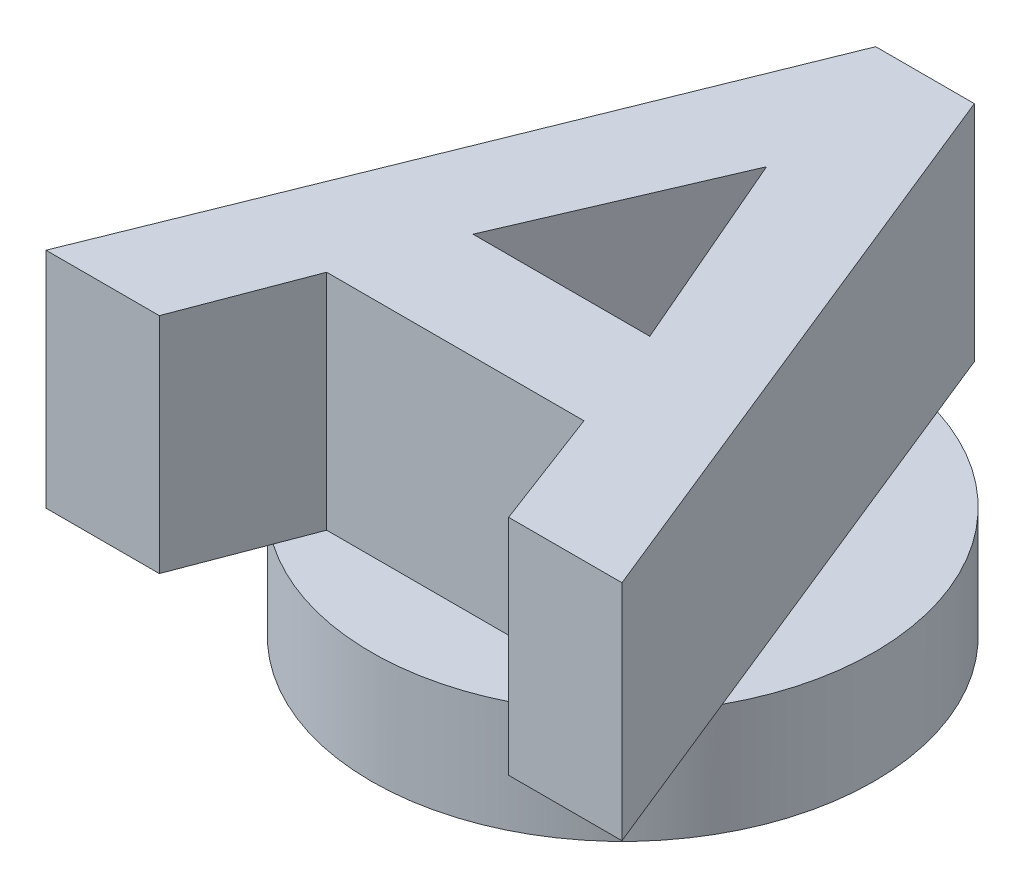
ISO-10303-21;
HEADER;
FILE_DESCRIPTION(('STEP AP214'),'2;1');
FILE_NAME('part.step','',(''),(''),'','','');
FILE_SCHEMA(('AUTOMOTIVE_DESIGN { 1 0 10303 214 1 1 1 1 }'));
ENDSEC;
DATA;
#1=APPLICATION_CONTEXT('core data for automotive mechanical design processes');
#2=APPLICATION_PROTOCOL_DEFINITION('international standard','automotive_design',2000,#1);
#3=PRODUCT_CONTEXT('',#1,'mechanical');
#4=PRODUCT('Part','Part','',(#3));
#5=PRODUCT_RELATED_PRODUCT_CATEGORY('part','',(#4));
#6=PRODUCT_DEFINITION_FORMATION('','',#4);
#7=PRODUCT_DEFINITION_CONTEXT('part definition',#1,'design');
#8=PRODUCT_DEFINITION('design','',#6,#7);
#9=PRODUCT_DEFINITION_SHAPE('','',#8);
#10=(LENGTH_UNIT() NAMED_UNIT(*) SI_UNIT(.MILLI.,.METRE.));
#11=(NAMED_UNIT(*) PLANE_ANGLE_UNIT() SI_UNIT($,.RADIAN.));
#12=(NAMED_UNIT(*) SI_UNIT($,.STERADIAN.) SOLID_ANGLE_UNIT());
#13=UNCERTAINTY_MEASURE_WITH_UNIT(LENGTH_MEASURE(1.E-05),#10,'distance_accuracy_value','');
#14=(GEOMETRIC_REPRESENTATION_CONTEXT(3) GLOBAL_UNCERTAINTY_ASSIGNED_CONTEXT((#13)) GLOBAL_UNIT_ASSIGNED_CONTEXT((#10,
#11,#12)) REPRESENTATION_CONTEXT('',''));
#15=CARTESIAN_POINT('',(0.,0.,0.));
#16=DIRECTION('',(0.,0.,1.));
#17=DIRECTION('',(1.,0.,0.));
#18=AXIS2_PLACEMENT_3D('',#15,#16,#17);
#19=CARTESIAN_POINT('',(0.,10.,0.));
#20=DIRECTION('',(0.,1.,0.));
#21=DIRECTION('',(0.,0.,1.));
#22=AXIS2_PLACEMENT_3D('',#19,#20,#21);
#23=PLANE('',#22);
#24=CARTESIAN_POINT('',(0.,10.,0.));
#25=DIRECTION('',(0.,1.,0.));
#26=DIRECTION('',(0.,0.,1.));
#27=AXIS2_PLACEMENT_3D('',#24,#25,#26);
#28=CIRCLE('',#27,22.5);
#29=CARTESIAN_POINT('',(-6.6136383890685,10.,-21.5060407155441));
#30=VERTEX_POINT('',#29);
#31=CARTESIAN_POINT('',(-19.6896862438374,10.,10.8888133246576));
#32=VERTEX_POINT('',#31);
#33=EDGE_CURVE('E313',#30,#32,#28,.T.);
#34=ORIENTED_EDGE('',*,*,#33,.T.);
#35=DIRECTION('',(0.3743033331008,0.,-0.927306322004564));
#36=VECTOR('',#35,1.);
#37=CARTESIAN_POINT('',(-25.7432937293359,10.,25.8861376758281));
#38=LINE('',#37,#36);
#39=EDGE_CURVE('E11',#32,#30,#38,.T.);
#40=ORIENTED_EDGE('',*,*,#39,.T.);
#41=EDGE_LOOP('',(#34,#40));
#42=FACE_BOUND('',#41,.T.);
#43=ADVANCED_FACE('F43',(#42),#23,.T.);
#44=CARTESIAN_POINT('',(19.7302042494278,10.,10.8152226179521));
#45=VERTEX_POINT('',#44);
#46=CARTESIAN_POINT('',(6.68648840026957,10.,-21.4835023418683));
#47=VERTEX_POINT('',#46);
#48=EDGE_CURVE('E300',#45,#47,#28,.T.);
#49=ORIENTED_EDGE('',*,*,#48,.T.);
#50=DIRECTION('',(0.374463049601283,0.,0.92724183710794));
#51=VECTOR('',#50,1.);
#52=CARTESIAN_POINT('',(4.44634302280082,10.,-27.0305289908385));
#53=LINE('',#52,#51);
#54=EDGE_CURVE('E52',#47,#45,#53,.T.);
#55=ORIENTED_EDGE('',*,*,#54,.T.);
#56=EDGE_LOOP('',(#49,#55));
#57=FACE_BOUND('',#56,.T.);
#58=ADVANCED_FACE('F335',(#57),#23,.T.);
#59=CARTESIAN_POINT('',(-12.7957142623065,10.,18.5072876596601));
#60=VERTEX_POINT('',#59);
#61=CARTESIAN_POINT('',(12.8594130005783,10.,18.463084717364));
#62=VERTEX_POINT('',#61);
#63=EDGE_CURVE('E301',#60,#62,#28,.T.);
#64=ORIENTED_EDGE('',*,*,#63,.T.);
#65=DIRECTION('',(-0.354323863096985,0.,-0.935122772709567));
#66=VECTOR('',#65,1.);
#67=CARTESIAN_POINT('',(15.6720541606213,10.,25.8861376758281));
#68=LINE('',#67,#66);
#69=CARTESIAN_POINT('',(11.5591401648948,10.,15.0314368211273));
#70=VERTEX_POINT('',#69);
#71=EDGE_CURVE('E273',#62,#70,#68,.T.);
#72=ORIENTED_EDGE('',*,*,#71,.T.);
#73=DIRECTION('',(-1.,0.,0.));
#74=VECTOR('',#73,1.);
#75=CARTESIAN_POINT('',(11.5591401648948,10.,15.0314368211273));
#76=LINE('',#75,#74);
#77=CARTESIAN_POINT('',(-11.4752982699342,10.,15.0314368211273));
#78=VERTEX_POINT('',#77);
#79=EDGE_CURVE('E272',#70,#78,#76,.T.);
#80=ORIENTED_EDGE('',*,*,#79,.T.);
#81=DIRECTION('',(-0.355122032430128,0.,0.934819951692675));
#82=VECTOR('',#81,1.);
#83=CARTESIAN_POINT('',(-11.4752982699342,10.,15.0314368211273));
#84=LINE('',#83,#82);
#85=EDGE_CURVE('E277',#78,#60,#84,.T.);
#86=ORIENTED_EDGE('',*,*,#85,.T.);
#87=EDGE_LOOP('',(#64,#72,#80,#86));
#88=FACE_BOUND('',#87,.T.);
#89=ADVANCED_FACE('F331',(#88),#23,.T.);
#90=CARTESIAN_POINT('',(0.,10.,0.));
#91=DIRECTION('',(0.,-1.,0.));
#92=DIRECTION('',(0.,0.,-1.));
#93=AXIS2_PLACEMENT_3D('',#90,#91,#92);
#94=CYLINDRICAL_SURFACE('',#93,22.5);
#95=EDGE_CURVE('E299',#62,#45,#28,.T.);
#96=ORIENTED_EDGE('',*,*,#95,.F.);
#97=ORIENTED_EDGE('',*,*,#63,.F.);
#98=EDGE_CURVE('E309',#32,#60,#28,.T.);
#99=ORIENTED_EDGE('',*,*,#98,.F.);
#100=ORIENTED_EDGE('',*,*,#33,.F.);
#101=EDGE_CURVE('E307',#47,#30,#28,.T.);
#102=ORIENTED_EDGE('',*,*,#101,.F.);
#103=ORIENTED_EDGE('',*,*,#48,.F.);
#104=EDGE_LOOP('',(#96,#97,#99,#100,#102,#103));
#105=FACE_BOUND('',#104,.T.);
#106=CARTESIAN_POINT('',(0.,0.,0.));
#107=DIRECTION('',(0.,1.,0.));
#108=DIRECTION('',(0.,0.,1.));
#109=AXIS2_PLACEMENT_3D('',#106,#107,#108);
#110=CIRCLE('',#109,22.5);
#111=CARTESIAN_POINT('',(0.,0.,22.5));
#112=VERTEX_POINT('',#111);
#113=EDGE_CURVE('E47',#112,#112,#110,.T.);
#114=ORIENTED_EDGE('',*,*,#113,.T.);
#115=EDGE_LOOP('',(#114));
#116=FACE_BOUND('',#115,.T.);
#117=ADVANCED_FACE('F45',(#105,#116),#94,.T.);
#118=CARTESIAN_POINT('',(0.,0.,0.));
#119=DIRECTION('',(0.,1.,0.));
#120=DIRECTION('',(0.,0.,1.));
#121=AXIS2_PLACEMENT_3D('',#118,#119,#120);
#122=PLANE('',#121);
#123=CARTESIAN_POINT('',(0.,0.,0.));
#124=DIRECTION('',(0.,-1.,0.));
#125=DIRECTION('',(0.,0.,-1.));
#126=AXIS2_PLACEMENT_3D('',#123,#124,#125);
#127=CIRCLE('',#126,21.5);
#128=CARTESIAN_POINT('',(4.83856503950974,0.,20.9484674465326));
#129=VERTEX_POINT('',#128);
#130=CARTESIAN_POINT('',(-4.83856503950294,0.,20.9484674465341));
#131=VERTEX_POINT('',#130);
#132=EDGE_CURVE('E202',#129,#131,#127,.T.);
#133=ORIENTED_EDGE('',*,*,#132,.F.);
#134=DIRECTION('',(-0.471428571428459,0.,0.881904247660097));
#135=VECTOR('',#134,1.);
#136=CARTESIAN_POINT('',(12.4726457883362,0.,6.66734693877418));
#137=LINE('',#136,#135);
#138=CARTESIAN_POINT('',(14.5514200863916,0.,2.77857142856957));
#139=VERTEX_POINT('',#138);
#140=EDGE_CURVE('E62',#139,#129,#137,.T.);
#141=ORIENTED_EDGE('',*,*,#140,.F.);
#142=CARTESIAN_POINT('',(0.,0.,-5.));
#143=DIRECTION('',(0.,-1.,0.));
#144=DIRECTION('',(0.,0.,-1.));
#145=AXIS2_PLACEMENT_3D('',#142,#143,#144);
#146=CIRCLE('',#145,16.5);
#147=CARTESIAN_POINT('',(-14.5514200863896,0.,2.77857142857328));
#148=VERTEX_POINT('',#147);
#149=EDGE_CURVE('E193',#148,#139,#146,.T.);
#150=ORIENTED_EDGE('',*,*,#149,.F.);
#151=DIRECTION('',(-0.471428571428684,0.,-0.881904247659977));
#152=VECTOR('',#151,1.);
#153=CARTESIAN_POINT('',(-12.4726457883335,0.,6.66734693877684));
#154=LINE('',#153,#152);
#155=EDGE_CURVE('E196',#131,#148,#154,.T.);
#156=ORIENTED_EDGE('',*,*,#155,.F.);
#157=EDGE_LOOP('',(#133,#141,#150,#156));
#158=FACE_BOUND('',#157,.T.);
#159=ORIENTED_EDGE('',*,*,#113,.F.);
#160=EDGE_LOOP('',(#159));
#161=FACE_BOUND('',#160,.T.);
#162=ADVANCED_FACE('F318',(#158,#161),#122,.F.);
#163=CARTESIAN_POINT('',(0.,10.,0.));
#164=DIRECTION('',(0.,-1.,0.));
#165=DIRECTION('',(0.,0.,-1.));
#166=AXIS2_PLACEMENT_3D('',#163,#164,#165);
#167=PLANE('',#166);
#168=CARTESIAN_POINT('',(15.6720541606213,10.,25.8861376758281));
#169=VERTEX_POINT('',#168);
#170=EDGE_CURVE('E269',#169,#62,#68,.T.);
#171=ORIENTED_EDGE('',*,*,#170,.T.);
#172=ORIENTED_EDGE('',*,*,#95,.T.);
#173=CARTESIAN_POINT('',(25.8165353304931,10.,25.8861376758281));
#174=VERTEX_POINT('',#173);
#175=EDGE_CURVE('E262',#45,#174,#53,.T.);
#176=ORIENTED_EDGE('',*,*,#175,.T.);
#177=DIRECTION('',(-1.,0.,0.));
#178=VECTOR('',#177,1.);
#179=CARTESIAN_POINT('',(25.8165353304931,10.,25.8861376758281));
#180=LINE('',#179,#178);
#181=EDGE_CURVE('E266',#174,#169,#180,.T.);
#182=ORIENTED_EDGE('',*,*,#181,.T.);
#183=EDGE_LOOP('',(#171,#172,#176,#182));
#184=FACE_BOUND('',#183,.T.);
#185=ADVANCED_FACE('F320',(#184),#167,.T.);
#186=CARTESIAN_POINT('',(4.44634302280082,10.,-27.0305289908385));
#187=VERTEX_POINT('',#186);
#188=EDGE_CURVE('E263',#187,#47,#53,.T.);
#189=ORIENTED_EDGE('',*,*,#188,.T.);
#190=ORIENTED_EDGE('',*,*,#101,.T.);
#191=CARTESIAN_POINT('',(-4.38370171544704,10.,-27.0305289908385));
#192=VERTEX_POINT('',#191);
#193=EDGE_CURVE('E55',#30,#192,#38,.T.);
#194=ORIENTED_EDGE('',*,*,#193,.T.);
#195=DIRECTION('',(1.,0.,0.));
#196=VECTOR('',#195,1.);
#197=CARTESIAN_POINT('',(-4.38370171544704,10.,-27.0305289908385));
#198=LINE('',#197,#196);
#199=EDGE_CURVE('E259',#192,#187,#198,.T.);
#200=ORIENTED_EDGE('',*,*,#199,.T.);
#201=EDGE_LOOP('',(#189,#190,#194,#200));
#202=FACE_BOUND('',#201,.T.);
#203=ADVANCED_FACE('F327',(#202),#167,.T.);
#204=CARTESIAN_POINT('',(0.,30.,0.));
#205=DIRECTION('',(0.,-1.,0.));
#206=DIRECTION('',(0.,0.,-1.));
#207=AXIS2_PLACEMENT_3D('',#204,#205,#206);
#208=PLANE('',#207);
#209=DIRECTION('',(0.3743033331008,0.,-0.927306322004564));
#210=VECTOR('',#209,1.);
#211=CARTESIAN_POINT('',(-25.7432937293359,30.,25.8861376758281));
#212=LINE('',#211,#210);
#213=CARTESIAN_POINT('',(-25.7432937293359,30.,25.8861376758281));
#214=VERTEX_POINT('',#213);
#215=CARTESIAN_POINT('',(-4.38370171544704,30.,-27.0305289908385));
#216=VERTEX_POINT('',#215);
#217=EDGE_CURVE('E232',#214,#216,#212,.T.);
#218=ORIENTED_EDGE('',*,*,#217,.F.);
#219=DIRECTION('',(-1.,0.,0.));
#220=VECTOR('',#219,1.);
#221=CARTESIAN_POINT('',(-15.5988125594641,30.,25.8861376758281));
#222=LINE('',#221,#220);
#223=CARTESIAN_POINT('',(-15.5988125594641,30.,25.8861376758281));
#224=VERTEX_POINT('',#223);
#225=EDGE_CURVE('E254',#224,#214,#222,.T.);
#226=ORIENTED_EDGE('',*,*,#225,.F.);
#227=DIRECTION('',(-0.355122032430128,0.,0.934819951692675));
#228=VECTOR('',#227,1.);
#229=CARTESIAN_POINT('',(-11.4752982699342,30.,15.0314368211273));
#230=LINE('',#229,#228);
#231=CARTESIAN_POINT('',(-11.4752982699342,30.,15.0314368211273));
#232=VERTEX_POINT('',#231);
#233=EDGE_CURVE('E251',#232,#224,#230,.T.);
#234=ORIENTED_EDGE('',*,*,#233,.F.);
#235=DIRECTION('',(-1.,0.,0.));
#236=VECTOR('',#235,1.);
#237=CARTESIAN_POINT('',(11.5591401648948,30.,15.0314368211273));
#238=LINE('',#237,#236);
#239=CARTESIAN_POINT('',(11.5591401648948,30.,15.0314368211273));
#240=VERTEX_POINT('',#239);
#241=EDGE_CURVE('E248',#240,#232,#238,.T.);
#242=ORIENTED_EDGE('',*,*,#241,.F.);
#243=DIRECTION('',(-0.354323863096985,0.,-0.935122772709567));
#244=VECTOR('',#243,1.);
#245=CARTESIAN_POINT('',(15.6720541606213,30.,25.8861376758281));
#246=LINE('',#245,#244);
#247=CARTESIAN_POINT('',(15.6720541606213,30.,25.8861376758281));
#248=VERTEX_POINT('',#247);
#249=EDGE_CURVE('E245',#248,#240,#246,.T.);
#250=ORIENTED_EDGE('',*,*,#249,.F.);
#251=DIRECTION('',(-1.,0.,0.));
#252=VECTOR('',#251,1.);
#253=CARTESIAN_POINT('',(25.8165353304931,30.,25.8861376758281));
#254=LINE('',#253,#252);
#255=CARTESIAN_POINT('',(25.8165353304931,30.,25.8861376758281));
#256=VERTEX_POINT('',#255);
#257=EDGE_CURVE('E242',#256,#248,#254,.T.);
#258=ORIENTED_EDGE('',*,*,#257,.F.);
#259=DIRECTION('',(0.374463049601283,0.,0.92724183710794));
#260=VECTOR('',#259,1.);
#261=CARTESIAN_POINT('',(4.44634302280082,30.,-27.0305289908385));
#262=LINE('',#261,#260);
#263=CARTESIAN_POINT('',(4.44634302280082,30.,-27.0305289908385));
#264=VERTEX_POINT('',#263);
#265=EDGE_CURVE('E239',#264,#256,#262,.T.);
#266=ORIENTED_EDGE('',*,*,#265,.F.);
#267=DIRECTION('',(1.,0.,0.));
#268=VECTOR('',#267,1.);
#269=CARTESIAN_POINT('',(-4.38370171544704,30.,-27.0305289908385));
#270=LINE('',#269,#268);
#271=EDGE_CURVE('E235',#216,#264,#270,.T.);
#272=ORIENTED_EDGE('',*,*,#271,.F.);
#273=EDGE_LOOP('',(#218,#226,#234,#242,#250,#258,#266,#272));
#274=FACE_BOUND('',#273,.T.);
#275=DIRECTION('',(-0.395837052329982,0.,-0.918320765311724));
#276=VECTOR('',#275,1.);
#277=CARTESIAN_POINT('',(7.95504027173245,30.,5.53357357326404));
#278=LINE('',#277,#276);
#279=CARTESIAN_POINT('',(7.95504027173245,30.,5.53357357326404));
#280=VERTEX_POINT('',#279);
#281=CARTESIAN_POINT('',(0.0366208005785976,30.,-12.8367355880607));
#282=VERTEX_POINT('',#281);
#283=EDGE_CURVE('E212',#280,#282,#278,.T.);
#284=ORIENTED_EDGE('',*,*,#283,.F.);
#285=DIRECTION('',(1.,0.,0.));
#286=VECTOR('',#285,1.);
#287=CARTESIAN_POINT('',(-7.87119837677183,30.,5.53357357326404));
#288=LINE('',#287,#286);
#289=CARTESIAN_POINT('',(-7.87119837677183,30.,5.53357357326404));
#290=VERTEX_POINT('',#289);
#291=EDGE_CURVE('E217',#290,#280,#288,.T.);
#292=ORIENTED_EDGE('',*,*,#291,.F.);
#293=DIRECTION('',(-0.395390038190867,0.,0.918513319282537));
#294=VECTOR('',#293,1.);
#295=CARTESIAN_POINT('',(0.0366208005785976,30.,-12.8367355880607));
#296=LINE('',#295,#294);
#297=EDGE_CURVE('E214',#282,#290,#296,.T.);
#298=ORIENTED_EDGE('',*,*,#297,.F.);
#299=EDGE_LOOP('',(#284,#292,#298));
#300=FACE_BOUND('',#299,.T.);
#301=ADVANCED_FACE('F375',(#274,#300),#208,.F.);
#302=CARTESIAN_POINT('',(-25.7432937293359,10.,25.8861376758281));
#303=VERTEX_POINT('',#302);
#304=EDGE_CURVE('E54',#303,#32,#38,.T.);
#305=ORIENTED_EDGE('',*,*,#304,.T.);
#306=ORIENTED_EDGE('',*,*,#98,.T.);
#307=CARTESIAN_POINT('',(-15.5988125594641,10.,25.8861376758281));
#308=VERTEX_POINT('',#307);
#309=EDGE_CURVE('E276',#60,#308,#84,.T.);
#310=ORIENTED_EDGE('',*,*,#309,.T.);
#311=DIRECTION('',(-1.,0.,0.));
#312=VECTOR('',#311,1.);
#313=CARTESIAN_POINT('',(-15.5988125594641,10.,25.8861376758281));
#314=LINE('',#313,#312);
#315=EDGE_CURVE('E236',#308,#303,#314,.T.);
#316=ORIENTED_EDGE('',*,*,#315,.T.);
#317=EDGE_LOOP('',(#305,#306,#310,#316));
#318=FACE_BOUND('',#317,.T.);
#319=ADVANCED_FACE('F329',(#318),#167,.T.);
#320=CARTESIAN_POINT('',(-25.7432937293359,30.,25.8861376758281));
#321=DIRECTION('',(-0.927306322004564,0.,-0.3743033331008));
#322=DIRECTION('',(-0.3743033331008,0.,0.927306322004564));
#323=AXIS2_PLACEMENT_3D('',#320,#321,#322);
#324=PLANE('',#323);
#325=ORIENTED_EDGE('',*,*,#304,.F.);
#326=DIRECTION('',(0.,-1.,0.));
#327=VECTOR('',#326,1.);
#328=CARTESIAN_POINT('',(-25.7432937293359,30.,25.8861376758281));
#329=LINE('',#328,#327);
#330=EDGE_CURVE('E282',#214,#303,#329,.T.);
#331=ORIENTED_EDGE('',*,*,#330,.F.);
#332=ORIENTED_EDGE('',*,*,#217,.T.);
#333=DIRECTION('',(0.,-1.,0.));
#334=VECTOR('',#333,1.);
#335=CARTESIAN_POINT('',(-4.38370171544704,30.,-27.0305289908385));
#336=LINE('',#335,#334);
#337=EDGE_CURVE('E256',#216,#192,#336,.T.);
#338=ORIENTED_EDGE('',*,*,#337,.T.);
#339=ORIENTED_EDGE('',*,*,#193,.F.);
#340=ORIENTED_EDGE('',*,*,#39,.F.);
#341=EDGE_LOOP('',(#325,#331,#332,#338,#339,#340));
#342=FACE_BOUND('',#341,.T.);
#343=ADVANCED_FACE('F391',(#342),#324,.T.);
#344=CARTESIAN_POINT('',(-15.5988125594641,30.,25.8861376758281));
#345=DIRECTION('',(0.,0.,1.));
#346=DIRECTION('',(1.,0.,0.));
#347=AXIS2_PLACEMENT_3D('',#344,#345,#346);
#348=PLANE('',#347);
#349=ORIENTED_EDGE('',*,*,#315,.F.);
#350=DIRECTION('',(0.,-1.,0.));
#351=VECTOR('',#350,1.);
#352=CARTESIAN_POINT('',(-15.5988125594641,30.,25.8861376758281));
#353=LINE('',#352,#351);
#354=EDGE_CURVE('E284',#224,#308,#353,.T.);
#355=ORIENTED_EDGE('',*,*,#354,.F.);
#356=ORIENTED_EDGE('',*,*,#225,.T.);
#357=ORIENTED_EDGE('',*,*,#330,.T.);
#358=EDGE_LOOP('',(#349,#355,#356,#357));
#359=FACE_BOUND('',#358,.T.);
#360=ADVANCED_FACE('F399',(#359),#348,.T.);
#361=CARTESIAN_POINT('',(-11.4752982699342,30.,15.0314368211273));
#362=DIRECTION('',(0.934819951692675,0.,0.355122032430128));
#363=DIRECTION('',(0.355122032430128,0.,-0.934819951692675));
#364=AXIS2_PLACEMENT_3D('',#361,#362,#363);
#365=PLANE('',#364);
#366=ORIENTED_EDGE('',*,*,#85,.F.);
#367=DIRECTION('',(0.,-1.,0.));
#368=VECTOR('',#367,1.);
#369=CARTESIAN_POINT('',(-11.4752982699342,30.,15.0314368211273));
#370=LINE('',#369,#368);
#371=EDGE_CURVE('E287',#232,#78,#370,.T.);
#372=ORIENTED_EDGE('',*,*,#371,.F.);
#373=ORIENTED_EDGE('',*,*,#233,.T.);
#374=ORIENTED_EDGE('',*,*,#354,.T.);
#375=ORIENTED_EDGE('',*,*,#309,.F.);
#376=EDGE_LOOP('',(#366,#372,#373,#374,#375));
#377=FACE_BOUND('',#376,.T.);
#378=ADVANCED_FACE('F407',(#377),#365,.T.);
#379=CARTESIAN_POINT('',(11.5591401648948,30.,15.0314368211273));
#380=DIRECTION('',(0.,0.,1.));
#381=DIRECTION('',(1.,0.,0.));
#382=AXIS2_PLACEMENT_3D('',#379,#380,#381);
#383=PLANE('',#382);
#384=ORIENTED_EDGE('',*,*,#79,.F.);
#385=DIRECTION('',(0.,-1.,0.));
#386=VECTOR('',#385,1.);
#387=CARTESIAN_POINT('',(11.5591401648948,30.,15.0314368211273));
#388=LINE('',#387,#386);
#389=EDGE_CURVE('E289',#240,#70,#388,.T.);
#390=ORIENTED_EDGE('',*,*,#389,.F.);
#391=ORIENTED_EDGE('',*,*,#241,.T.);
#392=ORIENTED_EDGE('',*,*,#371,.T.);
#393=EDGE_LOOP('',(#384,#390,#391,#392));
#394=FACE_BOUND('',#393,.T.);
#395=ADVANCED_FACE('F416',(#394),#383,.T.);
#396=CARTESIAN_POINT('',(15.6720541606213,30.,25.8861376758281));
#397=DIRECTION('',(-0.935122772709568,0.,0.354323863096985));
#398=DIRECTION('',(0.354323863096985,0.,0.935122772709568));
#399=AXIS2_PLACEMENT_3D('',#396,#397,#398);
#400=PLANE('',#399);
#401=ORIENTED_EDGE('',*,*,#170,.F.);
#402=DIRECTION('',(0.,-1.,0.));
#403=VECTOR('',#402,1.);
#404=CARTESIAN_POINT('',(15.6720541606213,30.,25.8861376758281));
#405=LINE('',#404,#403);
#406=EDGE_CURVE('E291',#248,#169,#405,.T.);
#407=ORIENTED_EDGE('',*,*,#406,.F.);
#408=ORIENTED_EDGE('',*,*,#249,.T.);
#409=ORIENTED_EDGE('',*,*,#389,.T.);
#410=ORIENTED_EDGE('',*,*,#71,.F.);
#411=EDGE_LOOP('',(#401,#407,#408,#409,#410));
#412=FACE_BOUND('',#411,.T.);
#413=ADVANCED_FACE('F425',(#412),#400,.T.);
#414=CARTESIAN_POINT('',(25.8165353304931,30.,25.8861376758281));
#415=DIRECTION('',(0.,0.,1.));
#416=DIRECTION('',(1.,0.,0.));
#417=AXIS2_PLACEMENT_3D('',#414,#415,#416);
#418=PLANE('',#417);
#419=ORIENTED_EDGE('',*,*,#181,.F.);
#420=DIRECTION('',(0.,-1.,0.));
#421=VECTOR('',#420,1.);
#422=CARTESIAN_POINT('',(25.8165353304931,30.,25.8861376758281));
#423=LINE('',#422,#421);
#424=EDGE_CURVE('E293',#256,#174,#423,.T.);
#425=ORIENTED_EDGE('',*,*,#424,.F.);
#426=ORIENTED_EDGE('',*,*,#257,.T.);
#427=ORIENTED_EDGE('',*,*,#406,.T.);
#428=EDGE_LOOP('',(#419,#425,#426,#427));
#429=FACE_BOUND('',#428,.T.);
#430=ADVANCED_FACE('F434',(#429),#418,.T.);
#431=CARTESIAN_POINT('',(4.44634302280082,30.,-27.0305289908385));
#432=DIRECTION('',(0.92724183710794,0.,-0.374463049601283));
#433=DIRECTION('',(-0.374463049601283,0.,-0.92724183710794));
#434=AXIS2_PLACEMENT_3D('',#431,#432,#433);
#435=PLANE('',#434);
#436=ORIENTED_EDGE('',*,*,#188,.F.);
#437=DIRECTION('',(0.,-1.,0.));
#438=VECTOR('',#437,1.);
#439=CARTESIAN_POINT('',(4.44634302280082,30.,-27.0305289908385));
#440=LINE('',#439,#438);
#441=EDGE_CURVE('E296',#264,#187,#440,.T.);
#442=ORIENTED_EDGE('',*,*,#441,.F.);
#443=ORIENTED_EDGE('',*,*,#265,.T.);
#444=ORIENTED_EDGE('',*,*,#424,.T.);
#445=ORIENTED_EDGE('',*,*,#175,.F.);
#446=ORIENTED_EDGE('',*,*,#54,.F.);
#447=EDGE_LOOP('',(#436,#442,#443,#444,#445,#446));
#448=FACE_BOUND('',#447,.T.);
#449=ADVANCED_FACE('F443',(#448),#435,.T.);
#450=CARTESIAN_POINT('',(-4.38370171544704,30.,-27.0305289908385));
#451=DIRECTION('',(0.,0.,-1.));
#452=DIRECTION('',(-1.,0.,0.));
#453=AXIS2_PLACEMENT_3D('',#450,#451,#452);
#454=PLANE('',#453);
#455=ORIENTED_EDGE('',*,*,#199,.F.);
#456=ORIENTED_EDGE('',*,*,#337,.F.);
#457=ORIENTED_EDGE('',*,*,#271,.T.);
#458=ORIENTED_EDGE('',*,*,#441,.T.);
#459=EDGE_LOOP('',(#455,#456,#457,#458));
#460=FACE_BOUND('',#459,.T.);
#461=ADVANCED_FACE('F452',(#460),#454,.T.);
#462=CARTESIAN_POINT('',(7.95504027173245,30.,5.53357357326404));
#463=DIRECTION('',(-0.918320765311724,0.,0.395837052329982));
#464=DIRECTION('',(0.395837052329982,0.,0.918320765311724));
#465=AXIS2_PLACEMENT_3D('',#462,#463,#464);
#466=PLANE('',#465);
#467=DIRECTION('',(-0.395837052329982,0.,-0.918320765311724));
#468=VECTOR('',#467,1.);
#469=CARTESIAN_POINT('',(7.95504027173245,10.,5.53357357326404));
#470=LINE('',#469,#468);
#471=CARTESIAN_POINT('',(7.95504027173245,10.,5.53357357326404));
#472=VERTEX_POINT('',#471);
#473=CARTESIAN_POINT('',(0.0366208005785976,10.,-12.8367355880607));
#474=VERTEX_POINT('',#473);
#475=EDGE_CURVE('E208',#472,#474,#470,.T.);
#476=ORIENTED_EDGE('',*,*,#475,.F.);
#477=DIRECTION('',(0.,-1.,0.));
#478=VECTOR('',#477,1.);
#479=CARTESIAN_POINT('',(7.95504027173245,30.,5.53357357326404));
#480=LINE('',#479,#478);
#481=EDGE_CURVE('E219',#280,#472,#480,.T.);
#482=ORIENTED_EDGE('',*,*,#481,.F.);
#483=ORIENTED_EDGE('',*,*,#283,.T.);
#484=DIRECTION('',(0.,-1.,0.));
#485=VECTOR('',#484,1.);
#486=CARTESIAN_POINT('',(0.0366208005785976,30.,-12.8367355880607));
#487=LINE('',#486,#485);
#488=EDGE_CURVE('E229',#282,#474,#487,.T.);
#489=ORIENTED_EDGE('',*,*,#488,.T.);
#490=EDGE_LOOP('',(#476,#482,#483,#489));
#491=FACE_BOUND('',#490,.T.);
#492=ADVANCED_FACE('F461',(#491),#466,.T.);
#493=CARTESIAN_POINT('',(0.0366208005785976,30.,-12.8367355880607));
#494=DIRECTION('',(0.918513319282538,0.,0.395390038190867));
#495=DIRECTION('',(0.395390038190867,0.,-0.918513319282538));
#496=AXIS2_PLACEMENT_3D('',#493,#494,#495);
#497=PLANE('',#496);
#498=DIRECTION('',(-0.395390038190867,0.,0.918513319282537));
#499=VECTOR('',#498,1.);
#500=CARTESIAN_POINT('',(0.0366208005785976,10.,-12.8367355880607));
#501=LINE('',#500,#499);
#502=CARTESIAN_POINT('',(-7.87119837677183,10.,5.53357357326404));
#503=VERTEX_POINT('',#502);
#504=EDGE_CURVE('E222',#474,#503,#501,.T.);
#505=ORIENTED_EDGE('',*,*,#504,.F.);
#506=ORIENTED_EDGE('',*,*,#488,.F.);
#507=ORIENTED_EDGE('',*,*,#297,.T.);
#508=DIRECTION('',(0.,-1.,0.));
#509=VECTOR('',#508,1.);
#510=CARTESIAN_POINT('',(-7.87119837677183,30.,5.53357357326404));
#511=LINE('',#510,#509);
#512=EDGE_CURVE('E227',#290,#503,#511,.T.);
#513=ORIENTED_EDGE('',*,*,#512,.T.);
#514=EDGE_LOOP('',(#505,#506,#507,#513));
#515=FACE_BOUND('',#514,.T.);
#516=ADVANCED_FACE('F351',(#515),#497,.T.);
#517=CARTESIAN_POINT('',(-7.87119837677183,30.,5.53357357326404));
#518=DIRECTION('',(0.,0.,-1.));
#519=DIRECTION('',(-1.,0.,0.));
#520=AXIS2_PLACEMENT_3D('',#517,#518,#519);
#521=PLANE('',#520);
#522=DIRECTION('',(1.,0.,0.));
#523=VECTOR('',#522,1.);
#524=CARTESIAN_POINT('',(-7.87119837677183,10.,5.53357357326404));
#525=LINE('',#524,#523);
#526=EDGE_CURVE('E70',#503,#472,#525,.T.);
#527=ORIENTED_EDGE('',*,*,#526,.F.);
#528=ORIENTED_EDGE('',*,*,#512,.F.);
#529=ORIENTED_EDGE('',*,*,#291,.T.);
#530=ORIENTED_EDGE('',*,*,#481,.T.);
#531=EDGE_LOOP('',(#527,#528,#529,#530));
#532=FACE_BOUND('',#531,.T.);
#533=ADVANCED_FACE('F344',(#532),#521,.T.);
#534=ORIENTED_EDGE('',*,*,#504,.T.);
#535=ORIENTED_EDGE('',*,*,#526,.T.);
#536=ORIENTED_EDGE('',*,*,#475,.T.);
#537=EDGE_LOOP('',(#534,#535,#536));
#538=FACE_BOUND('',#537,.T.);
#539=ADVANCED_FACE('F337',(#538),#23,.T.);
#540=CARTESIAN_POINT('',(12.4726457883362,5.,6.66734693877418));
#541=DIRECTION('',(0.881904247660097,0.,0.471428571428459));
#542=DIRECTION('',(0.471428571428459,0.,-0.881904247660097));
#543=AXIS2_PLACEMENT_3D('',#540,#541,#542);
#544=PLANE('',#543);
#545=ORIENTED_EDGE('',*,*,#140,.T.);
#546=DIRECTION('',(0.,-1.,0.));
#547=VECTOR('',#546,1.);
#548=CARTESIAN_POINT('',(4.83856503950974,5.,20.9484674465326));
#549=LINE('',#548,#547);
#550=CARTESIAN_POINT('',(4.83856503950974,5.,20.9484674465326));
#551=VERTEX_POINT('',#550);
#552=EDGE_CURVE('E171',#551,#129,#549,.T.);
#553=ORIENTED_EDGE('',*,*,#552,.F.);
#554=DIRECTION('',(-0.471428571428459,0.,0.881904247660097));
#555=VECTOR('',#554,1.);
#556=CARTESIAN_POINT('',(12.4726457883362,5.,6.66734693877418));
#557=LINE('',#556,#555);
#558=CARTESIAN_POINT('',(14.5514200863916,5.,2.77857142856957));
#559=VERTEX_POINT('',#558);
#560=EDGE_CURVE('E175',#559,#551,#557,.T.);
#561=ORIENTED_EDGE('',*,*,#560,.F.);
#562=DIRECTION('',(0.,-1.,0.));
#563=VECTOR('',#562,1.);
#564=CARTESIAN_POINT('',(14.5514200863916,5.,2.77857142856957));
#565=LINE('',#564,#563);
#566=EDGE_CURVE('E206',#559,#139,#565,.T.);
#567=ORIENTED_EDGE('',*,*,#566,.T.);
#568=EDGE_LOOP('',(#545,#553,#561,#567));
#569=FACE_BOUND('',#568,.T.);
#570=ADVANCED_FACE('F173',(#569),#544,.F.);
#571=CARTESIAN_POINT('',(0.,5.,-5.));
#572=DIRECTION('',(0.,-1.,0.));
#573=DIRECTION('',(0.,0.,-1.));
#574=AXIS2_PLACEMENT_3D('',#571,#572,#573);
#575=CYLINDRICAL_SURFACE('',#574,16.5);
#576=ORIENTED_EDGE('',*,*,#149,.T.);
#577=ORIENTED_EDGE('',*,*,#566,.F.);
#578=CARTESIAN_POINT('',(0.,5.,-5.));
#579=DIRECTION('',(0.,-1.,0.));
#580=DIRECTION('',(0.,0.,-1.));
#581=AXIS2_PLACEMENT_3D('',#578,#579,#580);
#582=CIRCLE('',#581,16.5);
#583=CARTESIAN_POINT('',(-14.5514200863896,5.,2.77857142857328));
#584=VERTEX_POINT('',#583);
#585=EDGE_CURVE('E181',#584,#559,#582,.T.);
#586=ORIENTED_EDGE('',*,*,#585,.F.);
#587=DIRECTION('',(0.,-1.,0.));
#588=VECTOR('',#587,1.);
#589=CARTESIAN_POINT('',(-14.5514200863896,5.,2.77857142857328));
#590=LINE('',#589,#588);
#591=EDGE_CURVE('E209',#584,#148,#590,.T.);
#592=ORIENTED_EDGE('',*,*,#591,.T.);
#593=EDGE_LOOP('',(#576,#577,#586,#592));
#594=FACE_BOUND('',#593,.T.);
#595=ADVANCED_FACE('F349',(#594),#575,.F.);
#596=CARTESIAN_POINT('',(-12.4726457883335,5.,6.66734693877684));
#597=DIRECTION('',(-0.881904247659977,0.,0.471428571428684));
#598=DIRECTION('',(0.471428571428684,0.,0.881904247659977));
#599=AXIS2_PLACEMENT_3D('',#596,#597,#598);
#600=PLANE('',#599);
#601=ORIENTED_EDGE('',*,*,#155,.T.);
#602=ORIENTED_EDGE('',*,*,#591,.F.);
#603=DIRECTION('',(-0.471428571428684,0.,-0.881904247659977));
#604=VECTOR('',#603,1.);
#605=CARTESIAN_POINT('',(-12.4726457883335,5.,6.66734693877684));
#606=LINE('',#605,#604);
#607=CARTESIAN_POINT('',(-4.83856503950294,5.,20.9484674465341));
#608=VERTEX_POINT('',#607);
#609=EDGE_CURVE('E189',#608,#584,#606,.T.);
#610=ORIENTED_EDGE('',*,*,#609,.F.);
#611=DIRECTION('',(0.,-1.,0.));
#612=VECTOR('',#611,1.);
#613=CARTESIAN_POINT('',(-4.83856503950294,5.,20.9484674465341));
#614=LINE('',#613,#612);
#615=EDGE_CURVE('E180',#608,#131,#614,.T.);
#616=ORIENTED_EDGE('',*,*,#615,.T.);
#617=EDGE_LOOP('',(#601,#602,#610,#616));
#618=FACE_BOUND('',#617,.T.);
#619=ADVANCED_FACE('F500',(#618),#600,.F.);
#620=CARTESIAN_POINT('',(0.,5.,0.));
#621=DIRECTION('',(0.,-1.,0.));
#622=DIRECTION('',(0.,0.,-1.));
#623=AXIS2_PLACEMENT_3D('',#620,#621,#622);
#624=CYLINDRICAL_SURFACE('',#623,21.5);
#625=ORIENTED_EDGE('',*,*,#132,.T.);
#626=ORIENTED_EDGE('',*,*,#615,.F.);
#627=CARTESIAN_POINT('',(0.,5.,0.));
#628=DIRECTION('',(0.,-1.,0.));
#629=DIRECTION('',(0.,0.,-1.));
#630=AXIS2_PLACEMENT_3D('',#627,#628,#629);
#631=CIRCLE('',#630,21.5);
#632=EDGE_CURVE('E184',#551,#608,#631,.T.);
#633=ORIENTED_EDGE('',*,*,#632,.F.);
#634=ORIENTED_EDGE('',*,*,#552,.T.);
#635=EDGE_LOOP('',(#625,#626,#633,#634));
#636=FACE_BOUND('',#635,.T.);
#637=ADVANCED_FACE('F185',(#636),#624,.F.);
#638=CARTESIAN_POINT('',(0.,5.,0.));
#639=DIRECTION('',(0.,-1.,0.));
#640=DIRECTION('',(0.,0.,-1.));
#641=AXIS2_PLACEMENT_3D('',#638,#639,#640);
#642=PLANE('',#641);
#643=ORIENTED_EDGE('',*,*,#560,.T.);
#644=ORIENTED_EDGE('',*,*,#632,.T.);
#645=ORIENTED_EDGE('',*,*,#609,.T.);
#646=ORIENTED_EDGE('',*,*,#585,.T.);
#647=EDGE_LOOP('',(#643,#644,#645,#646));
#648=FACE_BOUND('',#647,.T.);
#649=ADVANCED_FACE('F191',(#648),#642,.T.);
#650=CLOSED_SHELL('',(#43,#58,#89,#117,#162,#185,#203,#301,#319,#343,#360,#378,#395,#413,#430,
#449,#461,#492,#516,#533,#539,#570,#595,#619,#637,#649));
#651=MANIFOLD_SOLID_BREP('B2',#650);
#652=ADVANCED_BREP_SHAPE_REPRESENTATION('',(#18,#651),#14);
#653=SHAPE_DEFINITION_REPRESENTATION(#9,#652);
ENDSEC;
END-ISO-10303-21;
